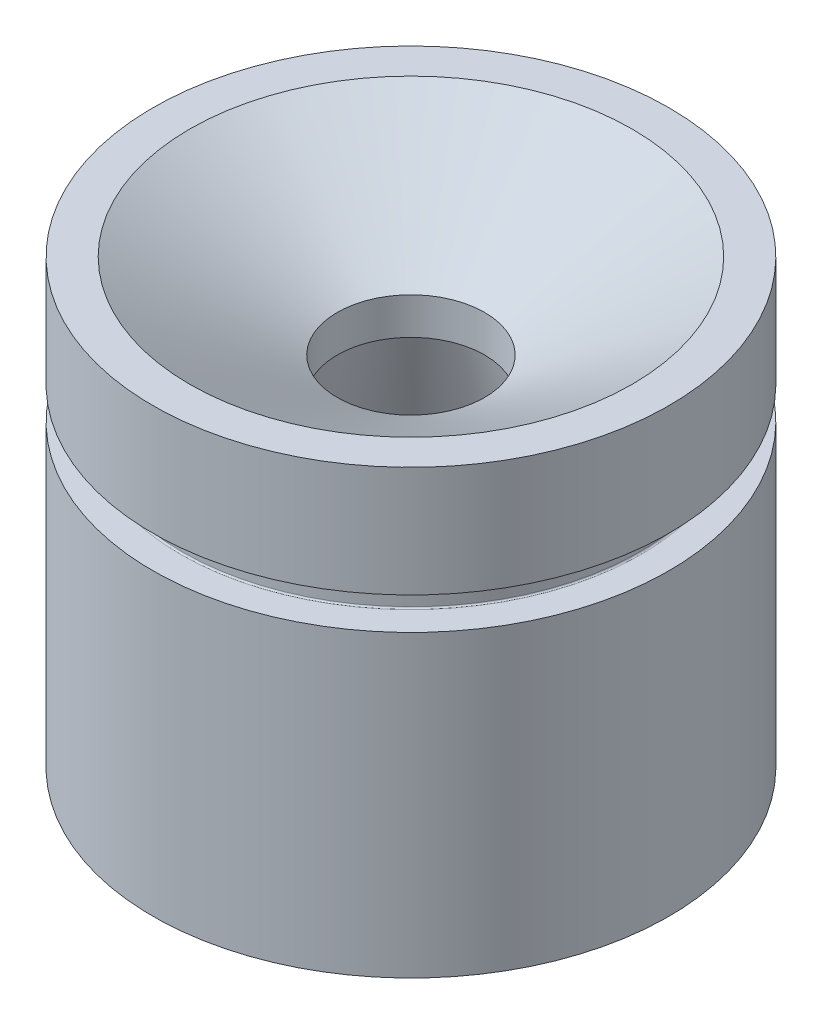
ISO-10303-21;
HEADER;
FILE_DESCRIPTION(('STEP AP214'),'2;1');
FILE_NAME('part.step','',(''),(''),'','','');
FILE_SCHEMA(('AUTOMOTIVE_DESIGN { 1 0 10303 214 1 1 1 1 }'));
ENDSEC;
DATA;
#1=APPLICATION_CONTEXT('core data for automotive mechanical design processes');
#2=APPLICATION_PROTOCOL_DEFINITION('international standard','automotive_design',2000,#1);
#3=PRODUCT_CONTEXT('',#1,'mechanical');
#4=PRODUCT('Part','Part','',(#3));
#5=PRODUCT_RELATED_PRODUCT_CATEGORY('part','',(#4));
#6=PRODUCT_DEFINITION_FORMATION('','',#4);
#7=PRODUCT_DEFINITION_CONTEXT('part definition',#1,'design');
#8=PRODUCT_DEFINITION('design','',#6,#7);
#9=PRODUCT_DEFINITION_SHAPE('','',#8);
#10=(LENGTH_UNIT() NAMED_UNIT(*) SI_UNIT(.MILLI.,.METRE.));
#11=(NAMED_UNIT(*) PLANE_ANGLE_UNIT() SI_UNIT($,.RADIAN.));
#12=(NAMED_UNIT(*) SI_UNIT($,.STERADIAN.) SOLID_ANGLE_UNIT());
#13=UNCERTAINTY_MEASURE_WITH_UNIT(LENGTH_MEASURE(1.E-05),#10,'distance_accuracy_value','');
#14=(GEOMETRIC_REPRESENTATION_CONTEXT(3) GLOBAL_UNCERTAINTY_ASSIGNED_CONTEXT((#13)) GLOBAL_UNIT_ASSIGNED_CONTEXT((#10,
#11,#12)) REPRESENTATION_CONTEXT('',''));
#15=CARTESIAN_POINT('',(0.,0.,0.));
#16=DIRECTION('',(0.,0.,1.));
#17=DIRECTION('',(1.,0.,0.));
#18=AXIS2_PLACEMENT_3D('',#15,#16,#17);
#19=CARTESIAN_POINT('',(0.,0.,0.));
#20=DIRECTION('',(0.,-1.,0.));
#21=DIRECTION('',(0.,0.,-1.));
#22=AXIS2_PLACEMENT_3D('',#19,#20,#21);
#23=CYLINDRICAL_SURFACE('',#22,44.45);
#24=CARTESIAN_POINT('',(0.,0.,0.));
#25=DIRECTION('',(0.,-1.,0.));
#26=DIRECTION('',(0.,0.,-1.));
#27=AXIS2_PLACEMENT_3D('',#24,#25,#26);
#28=CIRCLE('',#27,44.45);
#29=CARTESIAN_POINT('',(0.,0.,-44.45));
#30=VERTEX_POINT('',#29);
#31=EDGE_CURVE('E10',#30,#30,#28,.T.);
#32=ORIENTED_EDGE('',*,*,#31,.F.);
#33=EDGE_LOOP('',(#32));
#34=FACE_BOUND('',#33,.T.);
#35=CARTESIAN_POINT('',(0.,51.562,0.));
#36=DIRECTION('',(0.,-1.,0.));
#37=DIRECTION('',(0.,0.,-1.));
#38=AXIS2_PLACEMENT_3D('',#35,#36,#37);
#39=CIRCLE('',#38,44.45);
#40=CARTESIAN_POINT('',(0.,51.562,-44.45));
#41=VERTEX_POINT('',#40);
#42=EDGE_CURVE('E60',#41,#41,#39,.T.);
#43=ORIENTED_EDGE('',*,*,#42,.T.);
#44=EDGE_LOOP('',(#43));
#45=FACE_BOUND('',#44,.T.);
#46=ADVANCED_FACE('F34',(#34,#45),#23,.T.);
#47=CARTESIAN_POINT('',(0.,76.2,0.));
#48=DIRECTION('',(0.,-1.,0.));
#49=DIRECTION('',(0.,0.,-1.));
#50=AXIS2_PLACEMENT_3D('',#47,#48,#49);
#51=CIRCLE('',#50,44.45);
#52=CARTESIAN_POINT('',(0.,76.2,-44.45));
#53=VERTEX_POINT('',#52);
#54=EDGE_CURVE('E41',#53,#53,#51,.T.);
#55=ORIENTED_EDGE('',*,*,#54,.T.);
#56=EDGE_LOOP('',(#55));
#57=FACE_BOUND('',#56,.T.);
#58=CARTESIAN_POINT('',(0.,57.15,0.));
#59=DIRECTION('',(0.,-1.,0.));
#60=DIRECTION('',(0.,0.,-1.));
#61=AXIS2_PLACEMENT_3D('',#58,#59,#60);
#62=CIRCLE('',#61,44.45);
#63=CARTESIAN_POINT('',(0.,57.15,-44.45));
#64=VERTEX_POINT('',#63);
#65=EDGE_CURVE('E75',#64,#64,#62,.T.);
#66=ORIENTED_EDGE('',*,*,#65,.F.);
#67=EDGE_LOOP('',(#66));
#68=FACE_BOUND('',#67,.T.);
#69=ADVANCED_FACE('F82',(#57,#68),#23,.T.);
#70=CARTESIAN_POINT('',(-28.321,0.,0.));
#71=DIRECTION('',(0.,1.,0.));
#72=DIRECTION('',(0.,0.,1.));
#73=AXIS2_PLACEMENT_3D('',#70,#71,#72);
#74=PLANE('',#73);
#75=CARTESIAN_POINT('',(0.,0.,0.));
#76=DIRECTION('',(0.,-1.,0.));
#77=DIRECTION('',(0.,0.,-1.));
#78=AXIS2_PLACEMENT_3D('',#75,#76,#77);
#79=CIRCLE('',#78,28.321);
#80=CARTESIAN_POINT('',(0.,0.,-28.321));
#81=VERTEX_POINT('',#80);
#82=EDGE_CURVE('E57',#81,#81,#79,.T.);
#83=ORIENTED_EDGE('',*,*,#82,.F.);
#84=EDGE_LOOP('',(#83));
#85=FACE_BOUND('',#84,.T.);
#86=ORIENTED_EDGE('',*,*,#31,.T.);
#87=EDGE_LOOP('',(#86));
#88=FACE_BOUND('',#87,.T.);
#89=ADVANCED_FACE('F36',(#85,#88),#74,.F.);
#90=CARTESIAN_POINT('',(-44.45,76.2,0.));
#91=DIRECTION('',(0.,-1.,0.));
#92=DIRECTION('',(0.,0.,-1.));
#93=AXIS2_PLACEMENT_3D('',#90,#91,#92);
#94=PLANE('',#93);
#95=ORIENTED_EDGE('',*,*,#54,.F.);
#96=EDGE_LOOP('',(#95));
#97=FACE_BOUND('',#96,.T.);
#98=CARTESIAN_POINT('',(0.,76.2,0.));
#99=DIRECTION('',(0.,-1.,0.));
#100=DIRECTION('',(0.,0.,-1.));
#101=AXIS2_PLACEMENT_3D('',#98,#99,#100);
#102=CIRCLE('',#101,38.1);
#103=CARTESIAN_POINT('',(0.,76.2,-38.1));
#104=VERTEX_POINT('',#103);
#105=EDGE_CURVE('E45',#104,#104,#102,.T.);
#106=ORIENTED_EDGE('',*,*,#105,.T.);
#107=EDGE_LOOP('',(#106));
#108=FACE_BOUND('',#107,.T.);
#109=ADVANCED_FACE('F88',(#97,#108),#94,.F.);
#110=CARTESIAN_POINT('',(0.,61.5353031625835,0.));
#111=DIRECTION('',(0.,1.,0.));
#112=DIRECTION('',(0.,0.,1.));
#113=AXIS2_PLACEMENT_3D('',#110,#111,#112);
#114=CONICAL_SURFACE('',#113,12.7,1.0471975511966);
#115=ORIENTED_EDGE('',*,*,#105,.F.);
#116=EDGE_LOOP('',(#115));
#117=FACE_BOUND('',#116,.T.);
#118=CARTESIAN_POINT('',(0.,61.5353031625835,0.));
#119=DIRECTION('',(0.,-1.,0.));
#120=DIRECTION('',(0.,0.,-1.));
#121=AXIS2_PLACEMENT_3D('',#118,#119,#120);
#122=CIRCLE('',#121,12.7);
#123=CARTESIAN_POINT('',(0.,61.5353031625835,-12.7));
#124=VERTEX_POINT('',#123);
#125=EDGE_CURVE('E49',#124,#124,#122,.T.);
#126=ORIENTED_EDGE('',*,*,#125,.T.);
#127=EDGE_LOOP('',(#126));
#128=FACE_BOUND('',#127,.T.);
#129=ADVANCED_FACE('F94',(#117,#128),#114,.F.);
#130=CARTESIAN_POINT('',(0.,0.,0.));
#131=DIRECTION('',(0.,-1.,0.));
#132=DIRECTION('',(0.,0.,-1.));
#133=AXIS2_PLACEMENT_3D('',#130,#131,#132);
#134=CYLINDRICAL_SURFACE('',#133,12.7);
#135=ORIENTED_EDGE('',*,*,#125,.F.);
#136=EDGE_LOOP('',(#135));
#137=FACE_BOUND('',#136,.T.);
#138=CARTESIAN_POINT('',(0.,55.1853031625835,0.));
#139=DIRECTION('',(0.,-1.,0.));
#140=DIRECTION('',(0.,0.,-1.));
#141=AXIS2_PLACEMENT_3D('',#138,#139,#140);
#142=CIRCLE('',#141,12.7);
#143=CARTESIAN_POINT('',(0.,55.1853031625835,-12.7));
#144=VERTEX_POINT('',#143);
#145=EDGE_CURVE('E54',#144,#144,#142,.T.);
#146=ORIENTED_EDGE('',*,*,#145,.T.);
#147=EDGE_LOOP('',(#146));
#148=FACE_BOUND('',#147,.T.);
#149=ADVANCED_FACE('F98',(#137,#148),#134,.F.);
#150=CARTESIAN_POINT('',(0.,0.,0.));
#151=DIRECTION('',(0.,-1.,0.));
#152=DIRECTION('',(0.,0.,-1.));
#153=AXIS2_PLACEMENT_3D('',#150,#151,#152);
#154=CONICAL_SURFACE('',#153,28.321,0.27584814196086);
#155=ORIENTED_EDGE('',*,*,#145,.F.);
#156=EDGE_LOOP('',(#155));
#157=FACE_BOUND('',#156,.T.);
#158=ORIENTED_EDGE('',*,*,#82,.T.);
#159=EDGE_LOOP('',(#158));
#160=FACE_BOUND('',#159,.T.);
#161=ADVANCED_FACE('F102',(#157,#160),#154,.F.);
#162=CARTESIAN_POINT('',(-44.45,51.562,0.));
#163=DIRECTION('',(0.,1.,0.));
#164=DIRECTION('',(0.,0.,1.));
#165=AXIS2_PLACEMENT_3D('',#162,#163,#164);
#166=PLANE('',#165);
#167=CARTESIAN_POINT('',(0.,51.562,0.));
#168=DIRECTION('',(0.,-1.,0.));
#169=DIRECTION('',(0.,0.,-1.));
#170=AXIS2_PLACEMENT_3D('',#167,#168,#169);
#171=CIRCLE('',#170,39.624);
#172=CARTESIAN_POINT('',(0.,51.562,-39.624));
#173=VERTEX_POINT('',#172);
#174=EDGE_CURVE('E63',#173,#173,#171,.T.);
#175=ORIENTED_EDGE('',*,*,#174,.T.);
#176=EDGE_LOOP('',(#175));
#177=FACE_BOUND('',#176,.T.);
#178=ORIENTED_EDGE('',*,*,#42,.F.);
#179=EDGE_LOOP('',(#178));
#180=FACE_BOUND('',#179,.T.);
#181=ADVANCED_FACE('F106',(#177,#180),#166,.T.);
#182=CARTESIAN_POINT('',(0.,51.816,0.));
#183=DIRECTION('',(0.,-1.,0.));
#184=DIRECTION('',(0.,0.,-1.));
#185=AXIS2_PLACEMENT_3D('',#182,#183,#184);
#186=TOROIDAL_SURFACE('',#185,39.624,0.253999999999997);
#187=CARTESIAN_POINT('',(0.,51.816,0.));
#188=DIRECTION('',(0.,-1.,0.));
#189=DIRECTION('',(0.,0.,-1.));
#190=AXIS2_PLACEMENT_3D('',#187,#188,#189);
#191=CIRCLE('',#190,39.37);
#192=CARTESIAN_POINT('',(0.,51.816,-39.37));
#193=VERTEX_POINT('',#192);
#194=EDGE_CURVE('E66',#193,#193,#191,.T.);
#195=ORIENTED_EDGE('',*,*,#194,.T.);
#196=EDGE_LOOP('',(#195));
#197=FACE_BOUND('',#196,.T.);
#198=ORIENTED_EDGE('',*,*,#174,.F.);
#199=EDGE_LOOP('',(#198));
#200=FACE_BOUND('',#199,.T.);
#201=ADVANCED_FACE('F110',(#197,#200),#186,.F.);
#202=CARTESIAN_POINT('',(0.,0.,0.));
#203=DIRECTION('',(0.,-1.,0.));
#204=DIRECTION('',(0.,0.,-1.));
#205=AXIS2_PLACEMENT_3D('',#202,#203,#204);
#206=CYLINDRICAL_SURFACE('',#205,39.37);
#207=CARTESIAN_POINT('',(0.,56.896,0.));
#208=DIRECTION('',(0.,-1.,0.));
#209=DIRECTION('',(0.,0.,-1.));
#210=AXIS2_PLACEMENT_3D('',#207,#208,#209);
#211=CIRCLE('',#210,39.37);
#212=CARTESIAN_POINT('',(0.,56.896,-39.37));
#213=VERTEX_POINT('',#212);
#214=EDGE_CURVE('E69',#213,#213,#211,.T.);
#215=ORIENTED_EDGE('',*,*,#214,.T.);
#216=EDGE_LOOP('',(#215));
#217=FACE_BOUND('',#216,.T.);
#218=ORIENTED_EDGE('',*,*,#194,.F.);
#219=EDGE_LOOP('',(#218));
#220=FACE_BOUND('',#219,.T.);
#221=ADVANCED_FACE('F114',(#217,#220),#206,.T.);
#222=CARTESIAN_POINT('',(0.,56.896,0.));
#223=DIRECTION('',(0.,-1.,0.));
#224=DIRECTION('',(0.,0.,-1.));
#225=AXIS2_PLACEMENT_3D('',#222,#223,#224);
#226=TOROIDAL_SURFACE('',#225,39.624,0.253999999999997);
#227=CARTESIAN_POINT('',(0.,57.15,0.));
#228=DIRECTION('',(0.,-1.,0.));
#229=DIRECTION('',(0.,0.,-1.));
#230=AXIS2_PLACEMENT_3D('',#227,#228,#229);
#231=CIRCLE('',#230,39.624);
#232=CARTESIAN_POINT('',(0.,57.15,-39.624));
#233=VERTEX_POINT('',#232);
#234=EDGE_CURVE('E72',#233,#233,#231,.T.);
#235=ORIENTED_EDGE('',*,*,#234,.T.);
#236=EDGE_LOOP('',(#235));
#237=FACE_BOUND('',#236,.T.);
#238=ORIENTED_EDGE('',*,*,#214,.F.);
#239=EDGE_LOOP('',(#238));
#240=FACE_BOUND('',#239,.T.);
#241=ADVANCED_FACE('F118',(#237,#240),#226,.F.);
#242=CARTESIAN_POINT('',(-44.45,57.15,0.));
#243=DIRECTION('',(0.,-1.,0.));
#244=DIRECTION('',(0.,0.,-1.));
#245=AXIS2_PLACEMENT_3D('',#242,#243,#244);
#246=PLANE('',#245);
#247=ORIENTED_EDGE('',*,*,#65,.T.);
#248=EDGE_LOOP('',(#247));
#249=FACE_BOUND('',#248,.T.);
#250=ORIENTED_EDGE('',*,*,#234,.F.);
#251=EDGE_LOOP('',(#250));
#252=FACE_BOUND('',#251,.T.);
#253=ADVANCED_FACE('F79',(#249,#252),#246,.T.);
#254=CLOSED_SHELL('',(#46,#69,#89,#109,#129,#149,#161,#181,#201,#221,#241,#253));
#255=MANIFOLD_SOLID_BREP('B2',#254);
#256=ADVANCED_BREP_SHAPE_REPRESENTATION('',(#18,#255),#14);
#257=SHAPE_DEFINITION_REPRESENTATION(#9,#256);
ENDSEC;
END-ISO-10303-21;
